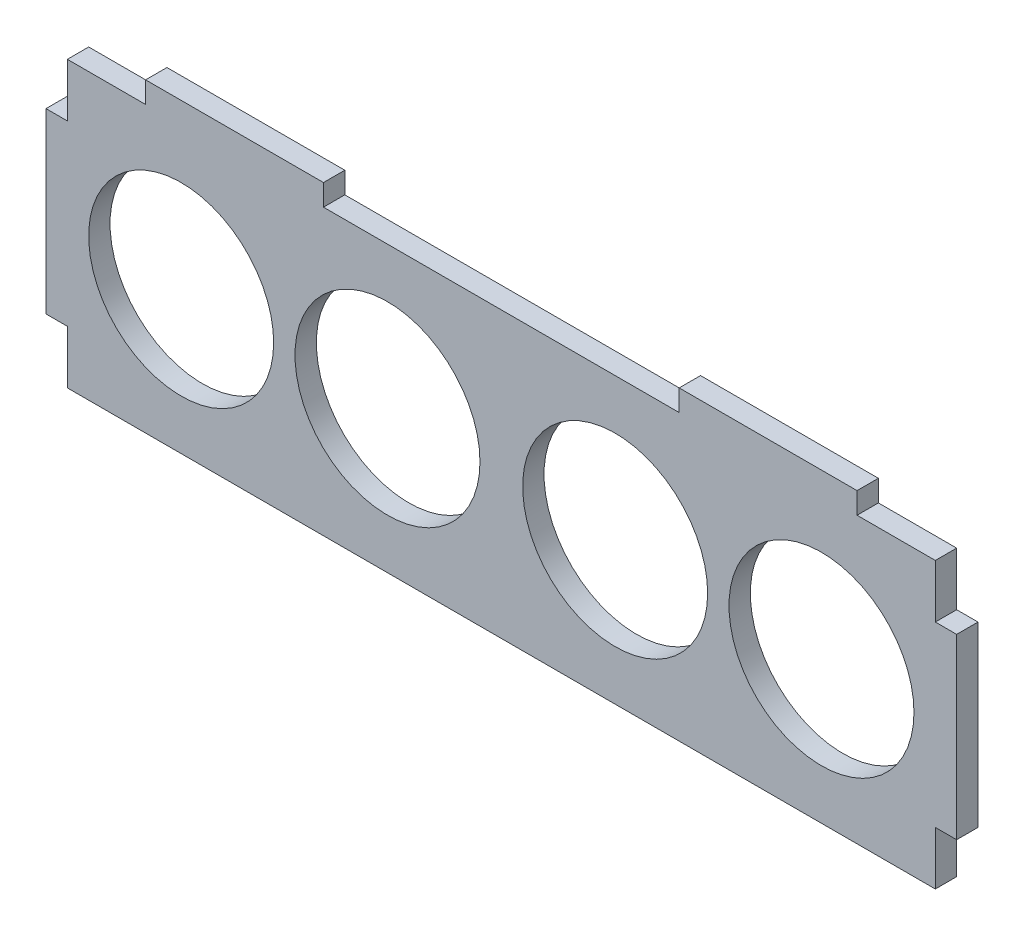
ISO-10303-21;
HEADER;
FILE_DESCRIPTION(('STEP AP214'),'2;1');
FILE_NAME('part.step','',(''),(''),'','','');
FILE_SCHEMA(('AUTOMOTIVE_DESIGN { 1 0 10303 214 1 1 1 1 }'));
ENDSEC;
DATA;
#1=APPLICATION_CONTEXT('core data for automotive mechanical design processes');
#2=APPLICATION_PROTOCOL_DEFINITION('international standard','automotive_design',2000,#1);
#3=PRODUCT_CONTEXT('',#1,'mechanical');
#4=PRODUCT('Part','Part','',(#3));
#5=PRODUCT_RELATED_PRODUCT_CATEGORY('part','',(#4));
#6=PRODUCT_DEFINITION_FORMATION('','',#4);
#7=PRODUCT_DEFINITION_CONTEXT('part definition',#1,'design');
#8=PRODUCT_DEFINITION('design','',#6,#7);
#9=PRODUCT_DEFINITION_SHAPE('','',#8);
#10=(LENGTH_UNIT() NAMED_UNIT(*) SI_UNIT(.MILLI.,.METRE.));
#11=(NAMED_UNIT(*) PLANE_ANGLE_UNIT() SI_UNIT($,.RADIAN.));
#12=(NAMED_UNIT(*) SI_UNIT($,.STERADIAN.) SOLID_ANGLE_UNIT());
#13=UNCERTAINTY_MEASURE_WITH_UNIT(LENGTH_MEASURE(1.E-05),#10,'distance_accuracy_value','');
#14=(GEOMETRIC_REPRESENTATION_CONTEXT(3) GLOBAL_UNCERTAINTY_ASSIGNED_CONTEXT((#13)) GLOBAL_UNIT_ASSIGNED_CONTEXT((#10,
#11,#12)) REPRESENTATION_CONTEXT('',''));
#15=CARTESIAN_POINT('',(0.,0.,0.));
#16=DIRECTION('',(0.,0.,1.));
#17=DIRECTION('',(1.,0.,0.));
#18=AXIS2_PLACEMENT_3D('',#15,#16,#17);
#19=CARTESIAN_POINT('',(0.,12.5,3.));
#20=DIRECTION('',(0.,-1.,0.));
#21=DIRECTION('',(0.,0.,-1.));
#22=AXIS2_PLACEMENT_3D('',#19,#20,#21);
#23=PLANE('',#22);
#24=DIRECTION('',(-1.,0.,0.));
#25=VECTOR('',#24,1.);
#26=CARTESIAN_POINT('',(0.,12.5,0.));
#27=LINE('',#26,#25);
#28=CARTESIAN_POINT('',(-61.,12.5,0.));
#29=VERTEX_POINT('',#28);
#30=CARTESIAN_POINT('',(-64.,12.5,0.));
#31=VERTEX_POINT('',#30);
#32=EDGE_CURVE('E298',#29,#31,#27,.T.);
#33=ORIENTED_EDGE('',*,*,#32,.T.);
#34=DIRECTION('',(0.,0.,-1.));
#35=VECTOR('',#34,1.);
#36=CARTESIAN_POINT('',(-64.,12.5,3.));
#37=LINE('',#36,#35);
#38=CARTESIAN_POINT('',(-64.,12.5,3.));
#39=VERTEX_POINT('',#38);
#40=EDGE_CURVE('E11',#39,#31,#37,.T.);
#41=ORIENTED_EDGE('',*,*,#40,.F.);
#42=DIRECTION('',(-1.,0.,0.));
#43=VECTOR('',#42,1.);
#44=CARTESIAN_POINT('',(0.,12.5,3.));
#45=LINE('',#44,#43);
#46=CARTESIAN_POINT('',(-61.,12.5,3.));
#47=VERTEX_POINT('',#46);
#48=EDGE_CURVE('E241',#47,#39,#45,.T.);
#49=ORIENTED_EDGE('',*,*,#48,.F.);
#50=DIRECTION('',(0.,0.,-1.));
#51=VECTOR('',#50,1.);
#52=CARTESIAN_POINT('',(-61.,12.5,3.));
#53=LINE('',#52,#51);
#54=EDGE_CURVE('E52',#47,#29,#53,.T.);
#55=ORIENTED_EDGE('',*,*,#54,.T.);
#56=EDGE_LOOP('',(#33,#41,#49,#55));
#57=FACE_BOUND('',#56,.T.);
#58=ADVANCED_FACE('F36',(#57),#23,.F.);
#59=CARTESIAN_POINT('',(-64.,0.,3.));
#60=DIRECTION('',(1.,0.,0.));
#61=DIRECTION('',(0.,0.,-1.));
#62=AXIS2_PLACEMENT_3D('',#59,#60,#61);
#63=PLANE('',#62);
#64=DIRECTION('',(0.,-1.,0.));
#65=VECTOR('',#64,1.);
#66=CARTESIAN_POINT('',(-64.,0.,0.));
#67=LINE('',#66,#65);
#68=CARTESIAN_POINT('',(-64.,-12.5,0.));
#69=VERTEX_POINT('',#68);
#70=EDGE_CURVE('E295',#31,#69,#67,.T.);
#71=ORIENTED_EDGE('',*,*,#70,.T.);
#72=DIRECTION('',(0.,0.,-1.));
#73=VECTOR('',#72,1.);
#74=CARTESIAN_POINT('',(-64.,-12.5,3.));
#75=LINE('',#74,#73);
#76=CARTESIAN_POINT('',(-64.,-12.5,3.));
#77=VERTEX_POINT('',#76);
#78=EDGE_CURVE('E44',#77,#69,#75,.T.);
#79=ORIENTED_EDGE('',*,*,#78,.F.);
#80=DIRECTION('',(0.,-1.,0.));
#81=VECTOR('',#80,1.);
#82=CARTESIAN_POINT('',(-64.,0.,3.));
#83=LINE('',#82,#81);
#84=EDGE_CURVE('E126',#39,#77,#83,.T.);
#85=ORIENTED_EDGE('',*,*,#84,.F.);
#86=ORIENTED_EDGE('',*,*,#40,.T.);
#87=EDGE_LOOP('',(#71,#79,#85,#86));
#88=FACE_BOUND('',#87,.T.);
#89=ADVANCED_FACE('F296',(#88),#63,.F.);
#90=CARTESIAN_POINT('',(0.,-12.5,3.));
#91=DIRECTION('',(0.,-1.,0.));
#92=DIRECTION('',(0.,0.,-1.));
#93=AXIS2_PLACEMENT_3D('',#90,#91,#92);
#94=PLANE('',#93);
#95=DIRECTION('',(-1.,0.,0.));
#96=VECTOR('',#95,1.);
#97=CARTESIAN_POINT('',(0.,-12.5,0.));
#98=LINE('',#97,#96);
#99=CARTESIAN_POINT('',(-61.,-12.5,0.));
#100=VERTEX_POINT('',#99);
#101=EDGE_CURVE('E292',#100,#69,#98,.T.);
#102=ORIENTED_EDGE('',*,*,#101,.F.);
#103=DIRECTION('',(0.,0.,-1.));
#104=VECTOR('',#103,1.);
#105=CARTESIAN_POINT('',(-61.,-12.5,3.));
#106=LINE('',#105,#104);
#107=CARTESIAN_POINT('',(-61.,-12.5,3.));
#108=VERTEX_POINT('',#107);
#109=EDGE_CURVE('E286',#108,#100,#106,.T.);
#110=ORIENTED_EDGE('',*,*,#109,.F.);
#111=DIRECTION('',(-1.,0.,0.));
#112=VECTOR('',#111,1.);
#113=CARTESIAN_POINT('',(0.,-12.5,3.));
#114=LINE('',#113,#112);
#115=EDGE_CURVE('E236',#108,#77,#114,.T.);
#116=ORIENTED_EDGE('',*,*,#115,.T.);
#117=ORIENTED_EDGE('',*,*,#78,.T.);
#118=EDGE_LOOP('',(#102,#110,#116,#117));
#119=FACE_BOUND('',#118,.T.);
#120=ADVANCED_FACE('F290',(#119),#94,.T.);
#121=CARTESIAN_POINT('',(-61.,0.,3.));
#122=DIRECTION('',(-1.,0.,0.));
#123=DIRECTION('',(0.,0.,1.));
#124=AXIS2_PLACEMENT_3D('',#121,#122,#123);
#125=PLANE('',#124);
#126=DIRECTION('',(0.,1.,0.));
#127=VECTOR('',#126,1.);
#128=CARTESIAN_POINT('',(-61.,0.,0.));
#129=LINE('',#128,#127);
#130=CARTESIAN_POINT('',(-61.,-20.,0.));
#131=VERTEX_POINT('',#130);
#132=EDGE_CURVE('E304',#131,#100,#129,.T.);
#133=ORIENTED_EDGE('',*,*,#132,.F.);
#134=DIRECTION('',(0.,0.,-1.));
#135=VECTOR('',#134,1.);
#136=CARTESIAN_POINT('',(-61.,-20.,3.));
#137=LINE('',#136,#135);
#138=CARTESIAN_POINT('',(-61.,-20.,3.));
#139=VERTEX_POINT('',#138);
#140=EDGE_CURVE('E284',#139,#131,#137,.T.);
#141=ORIENTED_EDGE('',*,*,#140,.F.);
#142=DIRECTION('',(0.,1.,0.));
#143=VECTOR('',#142,1.);
#144=CARTESIAN_POINT('',(-61.,0.,3.));
#145=LINE('',#144,#143);
#146=EDGE_CURVE('E206',#139,#108,#145,.T.);
#147=ORIENTED_EDGE('',*,*,#146,.T.);
#148=ORIENTED_EDGE('',*,*,#109,.T.);
#149=EDGE_LOOP('',(#133,#141,#147,#148));
#150=FACE_BOUND('',#149,.T.);
#151=ADVANCED_FACE('F438',(#150),#125,.T.);
#152=CARTESIAN_POINT('',(0.,-20.,3.));
#153=DIRECTION('',(0.,1.,0.));
#154=DIRECTION('',(0.,0.,1.));
#155=AXIS2_PLACEMENT_3D('',#152,#153,#154);
#156=PLANE('',#155);
#157=DIRECTION('',(1.,0.,0.));
#158=VECTOR('',#157,1.);
#159=CARTESIAN_POINT('',(0.,-20.,0.));
#160=LINE('',#159,#158);
#161=CARTESIAN_POINT('',(61.,-20.,0.));
#162=VERTEX_POINT('',#161);
#163=EDGE_CURVE('E306',#131,#162,#160,.T.);
#164=ORIENTED_EDGE('',*,*,#163,.T.);
#165=DIRECTION('',(0.,0.,-1.));
#166=VECTOR('',#165,1.);
#167=CARTESIAN_POINT('',(61.,-20.,3.));
#168=LINE('',#167,#166);
#169=CARTESIAN_POINT('',(61.,-20.,3.));
#170=VERTEX_POINT('',#169);
#171=EDGE_CURVE('E281',#170,#162,#168,.T.);
#172=ORIENTED_EDGE('',*,*,#171,.F.);
#173=DIRECTION('',(1.,0.,0.));
#174=VECTOR('',#173,1.);
#175=CARTESIAN_POINT('',(0.,-20.,3.));
#176=LINE('',#175,#174);
#177=EDGE_CURVE('E229',#139,#170,#176,.T.);
#178=ORIENTED_EDGE('',*,*,#177,.F.);
#179=ORIENTED_EDGE('',*,*,#140,.T.);
#180=EDGE_LOOP('',(#164,#172,#178,#179));
#181=FACE_BOUND('',#180,.T.);
#182=ADVANCED_FACE('F436',(#181),#156,.F.);
#183=CARTESIAN_POINT('',(61.,0.,3.));
#184=DIRECTION('',(-1.,0.,0.));
#185=DIRECTION('',(0.,0.,1.));
#186=AXIS2_PLACEMENT_3D('',#183,#184,#185);
#187=PLANE('',#186);
#188=DIRECTION('',(0.,1.,0.));
#189=VECTOR('',#188,1.);
#190=CARTESIAN_POINT('',(61.,0.,0.));
#191=LINE('',#190,#189);
#192=CARTESIAN_POINT('',(61.,-12.5,0.));
#193=VERTEX_POINT('',#192);
#194=EDGE_CURVE('E312',#162,#193,#191,.T.);
#195=ORIENTED_EDGE('',*,*,#194,.T.);
#196=DIRECTION('',(0.,0.,-1.));
#197=VECTOR('',#196,1.);
#198=CARTESIAN_POINT('',(61.,-12.5,3.));
#199=LINE('',#198,#197);
#200=CARTESIAN_POINT('',(61.,-12.5,3.));
#201=VERTEX_POINT('',#200);
#202=EDGE_CURVE('E278',#201,#193,#199,.T.);
#203=ORIENTED_EDGE('',*,*,#202,.F.);
#204=DIRECTION('',(0.,1.,0.));
#205=VECTOR('',#204,1.);
#206=CARTESIAN_POINT('',(61.,0.,3.));
#207=LINE('',#206,#205);
#208=EDGE_CURVE('E220',#170,#201,#207,.T.);
#209=ORIENTED_EDGE('',*,*,#208,.F.);
#210=ORIENTED_EDGE('',*,*,#171,.T.);
#211=EDGE_LOOP('',(#195,#203,#209,#210));
#212=FACE_BOUND('',#211,.T.);
#213=ADVANCED_FACE('F434',(#212),#187,.F.);
#214=CARTESIAN_POINT('',(0.,-12.4999999999999,3.));
#215=DIRECTION('',(0.,1.,0.));
#216=DIRECTION('',(-1.,0.,0.));
#217=AXIS2_PLACEMENT_3D('',#214,#215,#216);
#218=PLANE('',#217);
#219=DIRECTION('',(1.,0.,0.));
#220=VECTOR('',#219,1.);
#221=CARTESIAN_POINT('',(0.,-12.4999999999999,0.));
#222=LINE('',#221,#220);
#223=CARTESIAN_POINT('',(64.,-12.5,0.));
#224=VERTEX_POINT('',#223);
#225=EDGE_CURVE('E314',#193,#224,#222,.T.);
#226=ORIENTED_EDGE('',*,*,#225,.T.);
#227=DIRECTION('',(0.,0.,-1.));
#228=VECTOR('',#227,1.);
#229=CARTESIAN_POINT('',(64.,-12.5,3.));
#230=LINE('',#229,#228);
#231=CARTESIAN_POINT('',(64.,-12.5,3.));
#232=VERTEX_POINT('',#231);
#233=EDGE_CURVE('E276',#232,#224,#230,.T.);
#234=ORIENTED_EDGE('',*,*,#233,.F.);
#235=DIRECTION('',(1.,0.,0.));
#236=VECTOR('',#235,1.);
#237=CARTESIAN_POINT('',(0.,-12.4999999999999,3.));
#238=LINE('',#237,#236);
#239=EDGE_CURVE('E228',#201,#232,#238,.T.);
#240=ORIENTED_EDGE('',*,*,#239,.F.);
#241=ORIENTED_EDGE('',*,*,#202,.T.);
#242=EDGE_LOOP('',(#226,#234,#240,#241));
#243=FACE_BOUND('',#242,.T.);
#244=ADVANCED_FACE('F431',(#243),#218,.F.);
#245=CARTESIAN_POINT('',(64.,0.,3.));
#246=DIRECTION('',(1.,0.,0.));
#247=DIRECTION('',(0.,0.,-1.));
#248=AXIS2_PLACEMENT_3D('',#245,#246,#247);
#249=PLANE('',#248);
#250=DIRECTION('',(0.,-1.,0.));
#251=VECTOR('',#250,1.);
#252=CARTESIAN_POINT('',(64.,0.,0.));
#253=LINE('',#252,#251);
#254=CARTESIAN_POINT('',(64.,12.5,0.));
#255=VERTEX_POINT('',#254);
#256=EDGE_CURVE('E318',#255,#224,#253,.T.);
#257=ORIENTED_EDGE('',*,*,#256,.F.);
#258=DIRECTION('',(0.,0.,-1.));
#259=VECTOR('',#258,1.);
#260=CARTESIAN_POINT('',(64.,12.5,3.));
#261=LINE('',#260,#259);
#262=CARTESIAN_POINT('',(64.,12.5,3.));
#263=VERTEX_POINT('',#262);
#264=EDGE_CURVE('E274',#263,#255,#261,.T.);
#265=ORIENTED_EDGE('',*,*,#264,.F.);
#266=DIRECTION('',(0.,-1.,0.));
#267=VECTOR('',#266,1.);
#268=CARTESIAN_POINT('',(64.,0.,3.));
#269=LINE('',#268,#267);
#270=EDGE_CURVE('E225',#263,#232,#269,.T.);
#271=ORIENTED_EDGE('',*,*,#270,.T.);
#272=ORIENTED_EDGE('',*,*,#233,.T.);
#273=EDGE_LOOP('',(#257,#265,#271,#272));
#274=FACE_BOUND('',#273,.T.);
#275=ADVANCED_FACE('F426',(#274),#249,.T.);
#276=CARTESIAN_POINT('',(0.,12.5,3.));
#277=DIRECTION('',(0.,1.,0.));
#278=DIRECTION('',(0.,0.,1.));
#279=AXIS2_PLACEMENT_3D('',#276,#277,#278);
#280=PLANE('',#279);
#281=DIRECTION('',(1.,0.,0.));
#282=VECTOR('',#281,1.);
#283=CARTESIAN_POINT('',(0.,12.5,0.));
#284=LINE('',#283,#282);
#285=CARTESIAN_POINT('',(61.,12.5,0.));
#286=VERTEX_POINT('',#285);
#287=EDGE_CURVE('E321',#286,#255,#284,.T.);
#288=ORIENTED_EDGE('',*,*,#287,.F.);
#289=DIRECTION('',(0.,0.,-1.));
#290=VECTOR('',#289,1.);
#291=CARTESIAN_POINT('',(61.,12.5,3.));
#292=LINE('',#291,#290);
#293=CARTESIAN_POINT('',(61.,12.5,3.));
#294=VERTEX_POINT('',#293);
#295=EDGE_CURVE('E272',#294,#286,#292,.T.);
#296=ORIENTED_EDGE('',*,*,#295,.F.);
#297=DIRECTION('',(1.,0.,0.));
#298=VECTOR('',#297,1.);
#299=CARTESIAN_POINT('',(0.,12.5,3.));
#300=LINE('',#299,#298);
#301=EDGE_CURVE('E218',#294,#263,#300,.T.);
#302=ORIENTED_EDGE('',*,*,#301,.T.);
#303=ORIENTED_EDGE('',*,*,#264,.T.);
#304=EDGE_LOOP('',(#288,#296,#302,#303));
#305=FACE_BOUND('',#304,.T.);
#306=ADVANCED_FACE('F421',(#305),#280,.T.);
#307=CARTESIAN_POINT('',(61.,20.,0.));
#308=VERTEX_POINT('',#307);
#309=EDGE_CURVE('E315',#286,#308,#191,.T.);
#310=ORIENTED_EDGE('',*,*,#309,.T.);
#311=DIRECTION('',(0.,0.,-1.));
#312=VECTOR('',#311,1.);
#313=CARTESIAN_POINT('',(61.,20.,3.));
#314=LINE('',#313,#312);
#315=CARTESIAN_POINT('',(61.,20.,3.));
#316=VERTEX_POINT('',#315);
#317=EDGE_CURVE('E270',#316,#308,#314,.T.);
#318=ORIENTED_EDGE('',*,*,#317,.F.);
#319=EDGE_CURVE('E214',#294,#316,#207,.T.);
#320=ORIENTED_EDGE('',*,*,#319,.F.);
#321=ORIENTED_EDGE('',*,*,#295,.T.);
#322=EDGE_LOOP('',(#310,#318,#320,#321));
#323=FACE_BOUND('',#322,.T.);
#324=ADVANCED_FACE('F418',(#323),#187,.F.);
#325=CARTESIAN_POINT('',(0.,20.,3.));
#326=DIRECTION('',(0.,1.,0.));
#327=DIRECTION('',(0.,0.,1.));
#328=AXIS2_PLACEMENT_3D('',#325,#326,#327);
#329=PLANE('',#328);
#330=DIRECTION('',(1.,0.,0.));
#331=VECTOR('',#330,1.);
#332=CARTESIAN_POINT('',(0.,20.,0.));
#333=LINE('',#332,#331);
#334=CARTESIAN_POINT('',(50.,20.,0.));
#335=VERTEX_POINT('',#334);
#336=EDGE_CURVE('E324',#335,#308,#333,.T.);
#337=ORIENTED_EDGE('',*,*,#336,.F.);
#338=DIRECTION('',(0.,0.,-1.));
#339=VECTOR('',#338,1.);
#340=CARTESIAN_POINT('',(50.,20.,3.));
#341=LINE('',#340,#339);
#342=CARTESIAN_POINT('',(50.,20.,3.));
#343=VERTEX_POINT('',#342);
#344=EDGE_CURVE('E268',#343,#335,#341,.T.);
#345=ORIENTED_EDGE('',*,*,#344,.F.);
#346=DIRECTION('',(1.,0.,0.));
#347=VECTOR('',#346,1.);
#348=CARTESIAN_POINT('',(0.,20.,3.));
#349=LINE('',#348,#347);
#350=EDGE_CURVE('E203',#343,#316,#349,.T.);
#351=ORIENTED_EDGE('',*,*,#350,.T.);
#352=ORIENTED_EDGE('',*,*,#317,.T.);
#353=EDGE_LOOP('',(#337,#345,#351,#352));
#354=FACE_BOUND('',#353,.T.);
#355=ADVANCED_FACE('F415',(#354),#329,.T.);
#356=CARTESIAN_POINT('',(50.,0.,3.));
#357=DIRECTION('',(-1.,0.,0.));
#358=DIRECTION('',(0.,0.,1.));
#359=AXIS2_PLACEMENT_3D('',#356,#357,#358);
#360=PLANE('',#359);
#361=DIRECTION('',(0.,1.,0.));
#362=VECTOR('',#361,1.);
#363=CARTESIAN_POINT('',(50.,0.,0.));
#364=LINE('',#363,#362);
#365=CARTESIAN_POINT('',(50.,23.,0.));
#366=VERTEX_POINT('',#365);
#367=EDGE_CURVE('E327',#335,#366,#364,.T.);
#368=ORIENTED_EDGE('',*,*,#367,.T.);
#369=DIRECTION('',(0.,0.,-1.));
#370=VECTOR('',#369,1.);
#371=CARTESIAN_POINT('',(50.,23.,3.));
#372=LINE('',#371,#370);
#373=CARTESIAN_POINT('',(50.,23.,3.));
#374=VERTEX_POINT('',#373);
#375=EDGE_CURVE('E266',#374,#366,#372,.T.);
#376=ORIENTED_EDGE('',*,*,#375,.F.);
#377=DIRECTION('',(0.,1.,0.));
#378=VECTOR('',#377,1.);
#379=CARTESIAN_POINT('',(50.,0.,3.));
#380=LINE('',#379,#378);
#381=EDGE_CURVE('E213',#343,#374,#380,.T.);
#382=ORIENTED_EDGE('',*,*,#381,.F.);
#383=ORIENTED_EDGE('',*,*,#344,.T.);
#384=EDGE_LOOP('',(#368,#376,#382,#383));
#385=FACE_BOUND('',#384,.T.);
#386=ADVANCED_FACE('F555',(#385),#360,.F.);
#387=CARTESIAN_POINT('',(0.,23.,3.));
#388=DIRECTION('',(0.,1.,0.));
#389=DIRECTION('',(0.,0.,1.));
#390=AXIS2_PLACEMENT_3D('',#387,#388,#389);
#391=PLANE('',#390);
#392=DIRECTION('',(1.,0.,0.));
#393=VECTOR('',#392,1.);
#394=CARTESIAN_POINT('',(0.,23.,0.));
#395=LINE('',#394,#393);
#396=CARTESIAN_POINT('',(25.,23.,0.));
#397=VERTEX_POINT('',#396);
#398=EDGE_CURVE('E332',#397,#366,#395,.T.);
#399=ORIENTED_EDGE('',*,*,#398,.F.);
#400=DIRECTION('',(0.,0.,-1.));
#401=VECTOR('',#400,1.);
#402=CARTESIAN_POINT('',(25.,23.,3.));
#403=LINE('',#402,#401);
#404=CARTESIAN_POINT('',(25.,23.,3.));
#405=VERTEX_POINT('',#404);
#406=EDGE_CURVE('E264',#405,#397,#403,.T.);
#407=ORIENTED_EDGE('',*,*,#406,.F.);
#408=DIRECTION('',(1.,0.,0.));
#409=VECTOR('',#408,1.);
#410=CARTESIAN_POINT('',(0.,23.,3.));
#411=LINE('',#410,#409);
#412=EDGE_CURVE('E217',#405,#374,#411,.T.);
#413=ORIENTED_EDGE('',*,*,#412,.T.);
#414=ORIENTED_EDGE('',*,*,#375,.T.);
#415=EDGE_LOOP('',(#399,#407,#413,#414));
#416=FACE_BOUND('',#415,.T.);
#417=ADVANCED_FACE('F391',(#416),#391,.T.);
#418=CARTESIAN_POINT('',(25.,0.,3.));
#419=DIRECTION('',(-1.,0.,0.));
#420=DIRECTION('',(0.,0.,1.));
#421=AXIS2_PLACEMENT_3D('',#418,#419,#420);
#422=PLANE('',#421);
#423=DIRECTION('',(0.,1.,0.));
#424=VECTOR('',#423,1.);
#425=CARTESIAN_POINT('',(25.,0.,0.));
#426=LINE('',#425,#424);
#427=CARTESIAN_POINT('',(25.,20.,0.));
#428=VERTEX_POINT('',#427);
#429=EDGE_CURVE('E335',#428,#397,#426,.T.);
#430=ORIENTED_EDGE('',*,*,#429,.F.);
#431=DIRECTION('',(0.,0.,-1.));
#432=VECTOR('',#431,1.);
#433=CARTESIAN_POINT('',(25.,20.,3.));
#434=LINE('',#433,#432);
#435=CARTESIAN_POINT('',(25.,20.,3.));
#436=VERTEX_POINT('',#435);
#437=EDGE_CURVE('E262',#436,#428,#434,.T.);
#438=ORIENTED_EDGE('',*,*,#437,.F.);
#439=DIRECTION('',(0.,1.,0.));
#440=VECTOR('',#439,1.);
#441=CARTESIAN_POINT('',(25.,0.,3.));
#442=LINE('',#441,#440);
#443=EDGE_CURVE('E211',#436,#405,#442,.T.);
#444=ORIENTED_EDGE('',*,*,#443,.T.);
#445=ORIENTED_EDGE('',*,*,#406,.T.);
#446=EDGE_LOOP('',(#430,#438,#444,#445));
#447=FACE_BOUND('',#446,.T.);
#448=ADVANCED_FACE('F398',(#447),#422,.T.);
#449=CARTESIAN_POINT('',(-24.9999999999999,20.,0.));
#450=VERTEX_POINT('',#449);
#451=EDGE_CURVE('E329',#450,#428,#333,.T.);
#452=ORIENTED_EDGE('',*,*,#451,.F.);
#453=DIRECTION('',(0.,0.,-1.));
#454=VECTOR('',#453,1.);
#455=CARTESIAN_POINT('',(-24.9999999999999,20.,3.));
#456=LINE('',#455,#454);
#457=CARTESIAN_POINT('',(-24.9999999999999,20.,3.));
#458=VERTEX_POINT('',#457);
#459=EDGE_CURVE('E260',#458,#450,#456,.T.);
#460=ORIENTED_EDGE('',*,*,#459,.F.);
#461=EDGE_CURVE('E202',#458,#436,#349,.T.);
#462=ORIENTED_EDGE('',*,*,#461,.T.);
#463=ORIENTED_EDGE('',*,*,#437,.T.);
#464=EDGE_LOOP('',(#452,#460,#462,#463));
#465=FACE_BOUND('',#464,.T.);
#466=ADVANCED_FACE('F402',(#465),#329,.T.);
#467=CARTESIAN_POINT('',(-24.9999999999999,0.,3.));
#468=DIRECTION('',(-1.,0.,0.));
#469=DIRECTION('',(0.,0.,1.));
#470=AXIS2_PLACEMENT_3D('',#467,#468,#469);
#471=PLANE('',#470);
#472=DIRECTION('',(0.,1.,0.));
#473=VECTOR('',#472,1.);
#474=CARTESIAN_POINT('',(-24.9999999999999,0.,0.));
#475=LINE('',#474,#473);
#476=CARTESIAN_POINT('',(-24.9999999999999,23.,0.));
#477=VERTEX_POINT('',#476);
#478=EDGE_CURVE('E338',#450,#477,#475,.T.);
#479=ORIENTED_EDGE('',*,*,#478,.T.);
#480=DIRECTION('',(0.,0.,-1.));
#481=VECTOR('',#480,1.);
#482=CARTESIAN_POINT('',(-24.9999999999999,23.,3.));
#483=LINE('',#482,#481);
#484=CARTESIAN_POINT('',(-24.9999999999999,23.,3.));
#485=VERTEX_POINT('',#484);
#486=EDGE_CURVE('E258',#485,#477,#483,.T.);
#487=ORIENTED_EDGE('',*,*,#486,.F.);
#488=DIRECTION('',(0.,1.,0.));
#489=VECTOR('',#488,1.);
#490=CARTESIAN_POINT('',(-24.9999999999999,0.,3.));
#491=LINE('',#490,#489);
#492=EDGE_CURVE('E210',#458,#485,#491,.T.);
#493=ORIENTED_EDGE('',*,*,#492,.F.);
#494=ORIENTED_EDGE('',*,*,#459,.T.);
#495=EDGE_LOOP('',(#479,#487,#493,#494));
#496=FACE_BOUND('',#495,.T.);
#497=ADVANCED_FACE('F406',(#496),#471,.F.);
#498=CARTESIAN_POINT('',(0.,23.,3.));
#499=DIRECTION('',(0.,1.,0.));
#500=DIRECTION('',(0.,0.,1.));
#501=AXIS2_PLACEMENT_3D('',#498,#499,#500);
#502=PLANE('',#501);
#503=DIRECTION('',(1.,0.,0.));
#504=VECTOR('',#503,1.);
#505=CARTESIAN_POINT('',(0.,23.,0.));
#506=LINE('',#505,#504);
#507=CARTESIAN_POINT('',(-49.9999999999999,23.,0.));
#508=VERTEX_POINT('',#507);
#509=EDGE_CURVE('E341',#508,#477,#506,.T.);
#510=ORIENTED_EDGE('',*,*,#509,.F.);
#511=DIRECTION('',(0.,0.,-1.));
#512=VECTOR('',#511,1.);
#513=CARTESIAN_POINT('',(-49.9999999999999,23.,3.));
#514=LINE('',#513,#512);
#515=CARTESIAN_POINT('',(-49.9999999999999,23.,3.));
#516=VERTEX_POINT('',#515);
#517=EDGE_CURVE('E187',#516,#508,#514,.T.);
#518=ORIENTED_EDGE('',*,*,#517,.F.);
#519=DIRECTION('',(1.,0.,0.));
#520=VECTOR('',#519,1.);
#521=CARTESIAN_POINT('',(0.,23.,3.));
#522=LINE('',#521,#520);
#523=EDGE_CURVE('E197',#516,#485,#522,.T.);
#524=ORIENTED_EDGE('',*,*,#523,.T.);
#525=ORIENTED_EDGE('',*,*,#486,.T.);
#526=EDGE_LOOP('',(#510,#518,#524,#525));
#527=FACE_BOUND('',#526,.T.);
#528=ADVANCED_FACE('F410',(#527),#502,.T.);
#529=CARTESIAN_POINT('',(-49.9999999999999,0.,3.));
#530=DIRECTION('',(-1.,0.,0.));
#531=DIRECTION('',(0.,0.,1.));
#532=AXIS2_PLACEMENT_3D('',#529,#530,#531);
#533=PLANE('',#532);
#534=DIRECTION('',(0.,1.,0.));
#535=VECTOR('',#534,1.);
#536=CARTESIAN_POINT('',(-49.9999999999999,0.,0.));
#537=LINE('',#536,#535);
#538=CARTESIAN_POINT('',(-49.9999999999999,20.,0.));
#539=VERTEX_POINT('',#538);
#540=EDGE_CURVE('E183',#539,#508,#537,.T.);
#541=ORIENTED_EDGE('',*,*,#540,.F.);
#542=DIRECTION('',(0.,0.,-1.));
#543=VECTOR('',#542,1.);
#544=CARTESIAN_POINT('',(-49.9999999999999,20.,3.));
#545=LINE('',#544,#543);
#546=CARTESIAN_POINT('',(-49.9999999999999,20.,3.));
#547=VERTEX_POINT('',#546);
#548=EDGE_CURVE('E178',#547,#539,#545,.T.);
#549=ORIENTED_EDGE('',*,*,#548,.F.);
#550=DIRECTION('',(0.,1.,0.));
#551=VECTOR('',#550,1.);
#552=CARTESIAN_POINT('',(-49.9999999999999,0.,3.));
#553=LINE('',#552,#551);
#554=EDGE_CURVE('E181',#547,#516,#553,.T.);
#555=ORIENTED_EDGE('',*,*,#554,.T.);
#556=ORIENTED_EDGE('',*,*,#517,.T.);
#557=EDGE_LOOP('',(#541,#549,#555,#556));
#558=FACE_BOUND('',#557,.T.);
#559=ADVANCED_FACE('F180',(#558),#533,.T.);
#560=CARTESIAN_POINT('',(-61.,20.,0.));
#561=VERTEX_POINT('',#560);
#562=EDGE_CURVE('E328',#561,#539,#333,.T.);
#563=ORIENTED_EDGE('',*,*,#562,.F.);
#564=DIRECTION('',(0.,0.,-1.));
#565=VECTOR('',#564,1.);
#566=CARTESIAN_POINT('',(-61.,20.,3.));
#567=LINE('',#566,#565);
#568=CARTESIAN_POINT('',(-61.,20.,3.));
#569=VERTEX_POINT('',#568);
#570=EDGE_CURVE('E114',#569,#561,#567,.T.);
#571=ORIENTED_EDGE('',*,*,#570,.F.);
#572=EDGE_CURVE('E195',#569,#547,#349,.T.);
#573=ORIENTED_EDGE('',*,*,#572,.T.);
#574=ORIENTED_EDGE('',*,*,#548,.T.);
#575=EDGE_LOOP('',(#563,#571,#573,#574));
#576=FACE_BOUND('',#575,.T.);
#577=ADVANCED_FACE('F199',(#576),#329,.T.);
#578=CARTESIAN_POINT('',(45.,0.,3.));
#579=DIRECTION('',(0.,0.,-1.));
#580=DIRECTION('',(-1.,0.,0.));
#581=AXIS2_PLACEMENT_3D('',#578,#579,#580);
#582=CYLINDRICAL_SURFACE('',#581,13.);
#583=CARTESIAN_POINT('',(45.,0.,3.));
#584=DIRECTION('',(0.,0.,1.));
#585=DIRECTION('',(1.,0.,0.));
#586=AXIS2_PLACEMENT_3D('',#583,#584,#585);
#587=CIRCLE('',#586,13.);
#588=CARTESIAN_POINT('',(58.,0.,3.));
#589=VERTEX_POINT('',#588);
#590=EDGE_CURVE('E376',#589,#589,#587,.T.);
#591=ORIENTED_EDGE('',*,*,#590,.T.);
#592=EDGE_LOOP('',(#591));
#593=FACE_BOUND('',#592,.T.);
#594=CARTESIAN_POINT('',(45.,0.,0.));
#595=DIRECTION('',(0.,0.,1.));
#596=DIRECTION('',(1.,0.,0.));
#597=AXIS2_PLACEMENT_3D('',#594,#595,#596);
#598=CIRCLE('',#597,13.);
#599=CARTESIAN_POINT('',(58.,0.,0.));
#600=VERTEX_POINT('',#599);
#601=EDGE_CURVE('E245',#600,#600,#598,.T.);
#602=ORIENTED_EDGE('',*,*,#601,.F.);
#603=EDGE_LOOP('',(#602));
#604=FACE_BOUND('',#603,.T.);
#605=ADVANCED_FACE('F355',(#593,#604),#582,.F.);
#606=CARTESIAN_POINT('',(-16.,0.,3.));
#607=DIRECTION('',(0.,0.,-1.));
#608=DIRECTION('',(-1.,0.,0.));
#609=AXIS2_PLACEMENT_3D('',#606,#607,#608);
#610=CYLINDRICAL_SURFACE('',#609,13.);
#611=CARTESIAN_POINT('',(-16.,0.,3.));
#612=DIRECTION('',(0.,0.,1.));
#613=DIRECTION('',(1.,0.,0.));
#614=AXIS2_PLACEMENT_3D('',#611,#612,#613);
#615=CIRCLE('',#614,13.);
#616=CARTESIAN_POINT('',(-3.,0.,3.));
#617=VERTEX_POINT('',#616);
#618=EDGE_CURVE('E379',#617,#617,#615,.T.);
#619=ORIENTED_EDGE('',*,*,#618,.T.);
#620=EDGE_LOOP('',(#619));
#621=FACE_BOUND('',#620,.T.);
#622=CARTESIAN_POINT('',(-16.,0.,0.));
#623=DIRECTION('',(0.,0.,1.));
#624=DIRECTION('',(1.,0.,0.));
#625=AXIS2_PLACEMENT_3D('',#622,#623,#624);
#626=CIRCLE('',#625,13.);
#627=CARTESIAN_POINT('',(-3.,0.,0.));
#628=VERTEX_POINT('',#627);
#629=EDGE_CURVE('E250',#628,#628,#626,.T.);
#630=ORIENTED_EDGE('',*,*,#629,.F.);
#631=EDGE_LOOP('',(#630));
#632=FACE_BOUND('',#631,.T.);
#633=ADVANCED_FACE('F352',(#621,#632),#610,.F.);
#634=CARTESIAN_POINT('',(16.,0.,3.));
#635=DIRECTION('',(0.,0.,-1.));
#636=DIRECTION('',(-1.,0.,0.));
#637=AXIS2_PLACEMENT_3D('',#634,#635,#636);
#638=CYLINDRICAL_SURFACE('',#637,13.);
#639=CARTESIAN_POINT('',(16.,0.,3.));
#640=DIRECTION('',(0.,0.,1.));
#641=DIRECTION('',(1.,0.,0.));
#642=AXIS2_PLACEMENT_3D('',#639,#640,#641);
#643=CIRCLE('',#642,13.);
#644=CARTESIAN_POINT('',(29.,0.,3.));
#645=VERTEX_POINT('',#644);
#646=EDGE_CURVE('E204',#645,#645,#643,.T.);
#647=ORIENTED_EDGE('',*,*,#646,.T.);
#648=EDGE_LOOP('',(#647));
#649=FACE_BOUND('',#648,.T.);
#650=CARTESIAN_POINT('',(16.,0.,0.));
#651=DIRECTION('',(0.,0.,1.));
#652=DIRECTION('',(1.,0.,0.));
#653=AXIS2_PLACEMENT_3D('',#650,#651,#652);
#654=CIRCLE('',#653,13.);
#655=CARTESIAN_POINT('',(29.,0.,0.));
#656=VERTEX_POINT('',#655);
#657=EDGE_CURVE('E345',#656,#656,#654,.T.);
#658=ORIENTED_EDGE('',*,*,#657,.F.);
#659=EDGE_LOOP('',(#658));
#660=FACE_BOUND('',#659,.T.);
#661=ADVANCED_FACE('F354',(#649,#660),#638,.F.);
#662=EDGE_CURVE('E308',#29,#561,#129,.T.);
#663=ORIENTED_EDGE('',*,*,#662,.F.);
#664=ORIENTED_EDGE('',*,*,#54,.F.);
#665=EDGE_CURVE('E200',#47,#569,#145,.T.);
#666=ORIENTED_EDGE('',*,*,#665,.T.);
#667=ORIENTED_EDGE('',*,*,#570,.T.);
#668=EDGE_LOOP('',(#663,#664,#666,#667));
#669=FACE_BOUND('',#668,.T.);
#670=ADVANCED_FACE('F362',(#669),#125,.T.);
#671=CARTESIAN_POINT('',(-45.,0.,3.));
#672=DIRECTION('',(0.,0.,-1.));
#673=DIRECTION('',(-1.,0.,0.));
#674=AXIS2_PLACEMENT_3D('',#671,#672,#673);
#675=CYLINDRICAL_SURFACE('',#674,13.);
#676=CARTESIAN_POINT('',(-45.,0.,3.));
#677=DIRECTION('',(0.,0.,1.));
#678=DIRECTION('',(1.,0.,0.));
#679=AXIS2_PLACEMENT_3D('',#676,#677,#678);
#680=CIRCLE('',#679,13.);
#681=CARTESIAN_POINT('',(-32.,0.,3.));
#682=VERTEX_POINT('',#681);
#683=EDGE_CURVE('E255',#682,#682,#680,.T.);
#684=ORIENTED_EDGE('',*,*,#683,.T.);
#685=EDGE_LOOP('',(#684));
#686=FACE_BOUND('',#685,.T.);
#687=CARTESIAN_POINT('',(-45.,0.,0.));
#688=DIRECTION('',(0.,0.,1.));
#689=DIRECTION('',(1.,0.,0.));
#690=AXIS2_PLACEMENT_3D('',#687,#688,#689);
#691=CIRCLE('',#690,13.);
#692=CARTESIAN_POINT('',(-32.,0.,0.));
#693=VERTEX_POINT('',#692);
#694=EDGE_CURVE('E242',#693,#693,#691,.T.);
#695=ORIENTED_EDGE('',*,*,#694,.F.);
#696=EDGE_LOOP('',(#695));
#697=FACE_BOUND('',#696,.T.);
#698=ADVANCED_FACE('F449',(#686,#697),#675,.F.);
#699=CARTESIAN_POINT('',(0.,0.,3.));
#700=DIRECTION('',(0.,0.,1.));
#701=DIRECTION('',(1.,0.,0.));
#702=AXIS2_PLACEMENT_3D('',#699,#700,#701);
#703=PLANE('',#702);
#704=ORIENTED_EDGE('',*,*,#48,.T.);
#705=ORIENTED_EDGE('',*,*,#84,.T.);
#706=ORIENTED_EDGE('',*,*,#115,.F.);
#707=ORIENTED_EDGE('',*,*,#146,.F.);
#708=ORIENTED_EDGE('',*,*,#177,.T.);
#709=ORIENTED_EDGE('',*,*,#208,.T.);
#710=ORIENTED_EDGE('',*,*,#239,.T.);
#711=ORIENTED_EDGE('',*,*,#270,.F.);
#712=ORIENTED_EDGE('',*,*,#301,.F.);
#713=ORIENTED_EDGE('',*,*,#319,.T.);
#714=ORIENTED_EDGE('',*,*,#350,.F.);
#715=ORIENTED_EDGE('',*,*,#381,.T.);
#716=ORIENTED_EDGE('',*,*,#412,.F.);
#717=ORIENTED_EDGE('',*,*,#443,.F.);
#718=ORIENTED_EDGE('',*,*,#461,.F.);
#719=ORIENTED_EDGE('',*,*,#492,.T.);
#720=ORIENTED_EDGE('',*,*,#523,.F.);
#721=ORIENTED_EDGE('',*,*,#554,.F.);
#722=ORIENTED_EDGE('',*,*,#572,.F.);
#723=ORIENTED_EDGE('',*,*,#665,.F.);
#724=EDGE_LOOP('',(#704,#705,#706,#707,#708,#709,#710,#711,#712,#713,#714,#715,#716,#717,#718,
#719,#720,#721,#722,#723));
#725=FACE_BOUND('',#724,.T.);
#726=ORIENTED_EDGE('',*,*,#646,.F.);
#727=EDGE_LOOP('',(#726));
#728=FACE_BOUND('',#727,.T.);
#729=ORIENTED_EDGE('',*,*,#618,.F.);
#730=EDGE_LOOP('',(#729));
#731=FACE_BOUND('',#730,.T.);
#732=ORIENTED_EDGE('',*,*,#590,.F.);
#733=EDGE_LOOP('',(#732));
#734=FACE_BOUND('',#733,.T.);
#735=ORIENTED_EDGE('',*,*,#683,.F.);
#736=EDGE_LOOP('',(#735));
#737=FACE_BOUND('',#736,.T.);
#738=ADVANCED_FACE('F192',(#725,#728,#731,#734,#737),#703,.T.);
#739=CARTESIAN_POINT('',(0.,0.,0.));
#740=DIRECTION('',(0.,0.,1.));
#741=DIRECTION('',(1.,0.,0.));
#742=AXIS2_PLACEMENT_3D('',#739,#740,#741);
#743=PLANE('',#742);
#744=ORIENTED_EDGE('',*,*,#32,.F.);
#745=ORIENTED_EDGE('',*,*,#662,.T.);
#746=ORIENTED_EDGE('',*,*,#562,.T.);
#747=ORIENTED_EDGE('',*,*,#540,.T.);
#748=ORIENTED_EDGE('',*,*,#509,.T.);
#749=ORIENTED_EDGE('',*,*,#478,.F.);
#750=ORIENTED_EDGE('',*,*,#451,.T.);
#751=ORIENTED_EDGE('',*,*,#429,.T.);
#752=ORIENTED_EDGE('',*,*,#398,.T.);
#753=ORIENTED_EDGE('',*,*,#367,.F.);
#754=ORIENTED_EDGE('',*,*,#336,.T.);
#755=ORIENTED_EDGE('',*,*,#309,.F.);
#756=ORIENTED_EDGE('',*,*,#287,.T.);
#757=ORIENTED_EDGE('',*,*,#256,.T.);
#758=ORIENTED_EDGE('',*,*,#225,.F.);
#759=ORIENTED_EDGE('',*,*,#194,.F.);
#760=ORIENTED_EDGE('',*,*,#163,.F.);
#761=ORIENTED_EDGE('',*,*,#132,.T.);
#762=ORIENTED_EDGE('',*,*,#101,.T.);
#763=ORIENTED_EDGE('',*,*,#70,.F.);
#764=EDGE_LOOP('',(#744,#745,#746,#747,#748,#749,#750,#751,#752,#753,#754,#755,#756,#757,#758,
#759,#760,#761,#762,#763));
#765=FACE_BOUND('',#764,.T.);
#766=ORIENTED_EDGE('',*,*,#657,.T.);
#767=EDGE_LOOP('',(#766));
#768=FACE_BOUND('',#767,.T.);
#769=ORIENTED_EDGE('',*,*,#629,.T.);
#770=EDGE_LOOP('',(#769));
#771=FACE_BOUND('',#770,.T.);
#772=ORIENTED_EDGE('',*,*,#601,.T.);
#773=EDGE_LOOP('',(#772));
#774=FACE_BOUND('',#773,.T.);
#775=ORIENTED_EDGE('',*,*,#694,.T.);
#776=EDGE_LOOP('',(#775));
#777=FACE_BOUND('',#776,.T.);
#778=ADVANCED_FACE('F300',(#765,#768,#771,#774,#777),#743,.F.);
#779=CLOSED_SHELL('',(#58,#89,#120,#151,#182,#213,#244,#275,#306,#324,#355,#386,#417,#448,#466,
#497,#528,#559,#577,#605,#633,#661,#670,#698,#738,#778));
#780=MANIFOLD_SOLID_BREP('B2',#779);
#781=ADVANCED_BREP_SHAPE_REPRESENTATION('',(#18,#780),#14);
#782=SHAPE_DEFINITION_REPRESENTATION(#9,#781);
ENDSEC;
END-ISO-10303-21;
